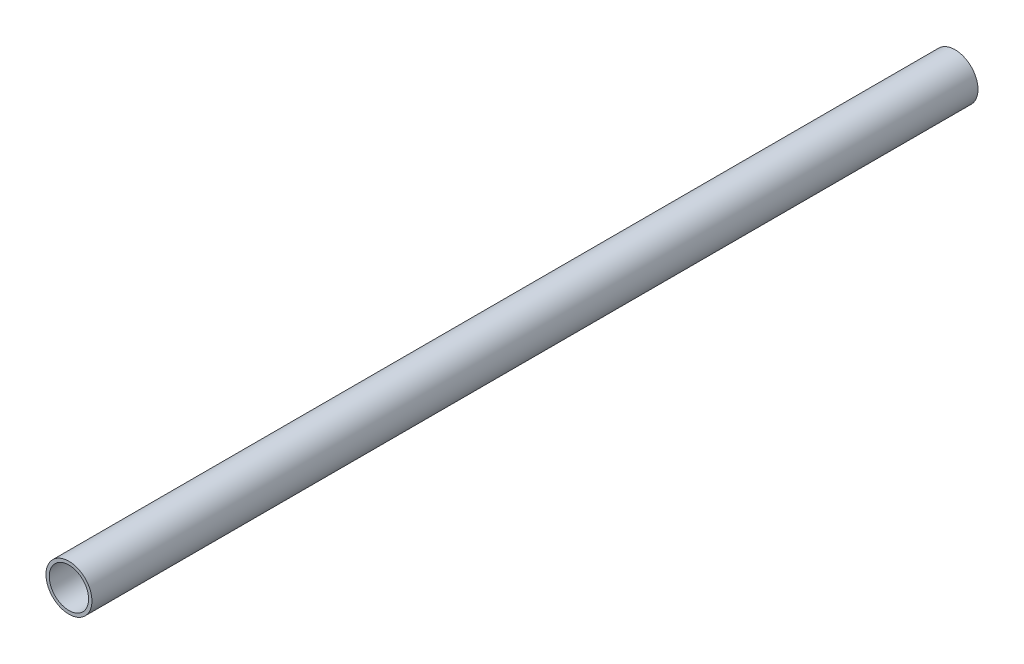
ISO-10303-21;
HEADER;
FILE_DESCRIPTION(('STEP AP214'),'2;1');
FILE_NAME('part.step','',(''),(''),'','','');
FILE_SCHEMA(('AUTOMOTIVE_DESIGN { 1 0 10303 214 1 1 1 1 }'));
ENDSEC;
DATA;
#1=APPLICATION_CONTEXT('core data for automotive mechanical design processes');
#2=APPLICATION_PROTOCOL_DEFINITION('international standard','automotive_design',2000,#1);
#3=PRODUCT_CONTEXT('',#1,'mechanical');
#4=PRODUCT('Part','Part','',(#3));
#5=PRODUCT_RELATED_PRODUCT_CATEGORY('part','',(#4));
#6=PRODUCT_DEFINITION_FORMATION('','',#4);
#7=PRODUCT_DEFINITION_CONTEXT('part definition',#1,'design');
#8=PRODUCT_DEFINITION('design','',#6,#7);
#9=PRODUCT_DEFINITION_SHAPE('','',#8);
#10=(LENGTH_UNIT() NAMED_UNIT(*) SI_UNIT(.MILLI.,.METRE.));
#11=(NAMED_UNIT(*) PLANE_ANGLE_UNIT() SI_UNIT($,.RADIAN.));
#12=(NAMED_UNIT(*) SI_UNIT($,.STERADIAN.) SOLID_ANGLE_UNIT());
#13=UNCERTAINTY_MEASURE_WITH_UNIT(LENGTH_MEASURE(1.E-05),#10,'distance_accuracy_value','');
#14=(GEOMETRIC_REPRESENTATION_CONTEXT(3) GLOBAL_UNCERTAINTY_ASSIGNED_CONTEXT((#13)) GLOBAL_UNIT_ASSIGNED_CONTEXT((#10,
#11,#12)) REPRESENTATION_CONTEXT('',''));
#15=CARTESIAN_POINT('',(0.,0.,0.));
#16=DIRECTION('',(0.,0.,1.));
#17=DIRECTION('',(1.,0.,0.));
#18=AXIS2_PLACEMENT_3D('',#15,#16,#17);
#19=CARTESIAN_POINT('',(0.,0.,270.));
#20=DIRECTION('',(0.,0.,-1.));
#21=DIRECTION('',(-1.,0.,0.));
#22=AXIS2_PLACEMENT_3D('',#19,#20,#21);
#23=CYLINDRICAL_SURFACE('',#22,7.);
#24=CARTESIAN_POINT('',(0.,0.,270.));
#25=DIRECTION('',(0.,0.,1.));
#26=DIRECTION('',(1.,0.,0.));
#27=AXIS2_PLACEMENT_3D('',#24,#25,#26);
#28=CIRCLE('',#27,7.);
#29=CARTESIAN_POINT('',(7.,0.,270.));
#30=VERTEX_POINT('',#29);
#31=EDGE_CURVE('E10',#30,#30,#28,.T.);
#32=ORIENTED_EDGE('',*,*,#31,.F.);
#33=EDGE_LOOP('',(#32));
#34=FACE_BOUND('',#33,.T.);
#35=CARTESIAN_POINT('',(0.,0.,0.));
#36=DIRECTION('',(0.,0.,1.));
#37=DIRECTION('',(1.,0.,0.));
#38=AXIS2_PLACEMENT_3D('',#35,#36,#37);
#39=CIRCLE('',#38,7.);
#40=CARTESIAN_POINT('',(7.,0.,0.));
#41=VERTEX_POINT('',#40);
#42=EDGE_CURVE('E40',#41,#41,#39,.T.);
#43=ORIENTED_EDGE('',*,*,#42,.T.);
#44=EDGE_LOOP('',(#43));
#45=FACE_BOUND('',#44,.T.);
#46=ADVANCED_FACE('F37',(#34,#45),#23,.T.);
#47=CARTESIAN_POINT('',(0.,0.,270.));
#48=DIRECTION('',(0.,0.,1.));
#49=DIRECTION('',(1.,0.,0.));
#50=AXIS2_PLACEMENT_3D('',#47,#48,#49);
#51=PLANE('',#50);
#52=CARTESIAN_POINT('',(0.,0.,270.));
#53=DIRECTION('',(0.,0.,1.));
#54=DIRECTION('',(1.,0.,0.));
#55=AXIS2_PLACEMENT_3D('',#52,#53,#54);
#56=CIRCLE('',#55,6.);
#57=CARTESIAN_POINT('',(6.,0.,270.));
#58=VERTEX_POINT('',#57);
#59=EDGE_CURVE('E51',#58,#58,#56,.T.);
#60=ORIENTED_EDGE('',*,*,#59,.F.);
#61=EDGE_LOOP('',(#60));
#62=FACE_BOUND('',#61,.T.);
#63=ORIENTED_EDGE('',*,*,#31,.T.);
#64=EDGE_LOOP('',(#63));
#65=FACE_BOUND('',#64,.T.);
#66=ADVANCED_FACE('F68',(#62,#65),#51,.T.);
#67=CARTESIAN_POINT('',(0.,0.,0.));
#68=DIRECTION('',(0.,0.,1.));
#69=DIRECTION('',(1.,0.,0.));
#70=AXIS2_PLACEMENT_3D('',#67,#68,#69);
#71=PLANE('',#70);
#72=CARTESIAN_POINT('',(0.,0.,0.));
#73=DIRECTION('',(0.,0.,1.));
#74=DIRECTION('',(1.,0.,0.));
#75=AXIS2_PLACEMENT_3D('',#72,#73,#74);
#76=CIRCLE('',#75,6.);
#77=CARTESIAN_POINT('',(6.,0.,0.));
#78=VERTEX_POINT('',#77);
#79=EDGE_CURVE('E49',#78,#78,#76,.T.);
#80=ORIENTED_EDGE('',*,*,#79,.T.);
#81=EDGE_LOOP('',(#80));
#82=FACE_BOUND('',#81,.T.);
#83=ORIENTED_EDGE('',*,*,#42,.F.);
#84=EDGE_LOOP('',(#83));
#85=FACE_BOUND('',#84,.T.);
#86=ADVANCED_FACE('F59',(#82,#85),#71,.F.);
#87=CARTESIAN_POINT('',(0.,0.,0.));
#88=DIRECTION('',(0.,0.,1.));
#89=DIRECTION('',(1.,0.,0.));
#90=AXIS2_PLACEMENT_3D('',#87,#88,#89);
#91=CYLINDRICAL_SURFACE('',#90,6.);
#92=ORIENTED_EDGE('',*,*,#79,.F.);
#93=EDGE_LOOP('',(#92));
#94=FACE_BOUND('',#93,.T.);
#95=ORIENTED_EDGE('',*,*,#59,.T.);
#96=EDGE_LOOP('',(#95));
#97=FACE_BOUND('',#96,.T.);
#98=ADVANCED_FACE('F62',(#94,#97),#91,.F.);
#99=CLOSED_SHELL('',(#46,#66,#86,#98));
#100=MANIFOLD_SOLID_BREP('B2',#99);
#101=ADVANCED_BREP_SHAPE_REPRESENTATION('',(#18,#100),#14);
#102=SHAPE_DEFINITION_REPRESENTATION(#9,#101);
ENDSEC;
END-ISO-10303-21;
